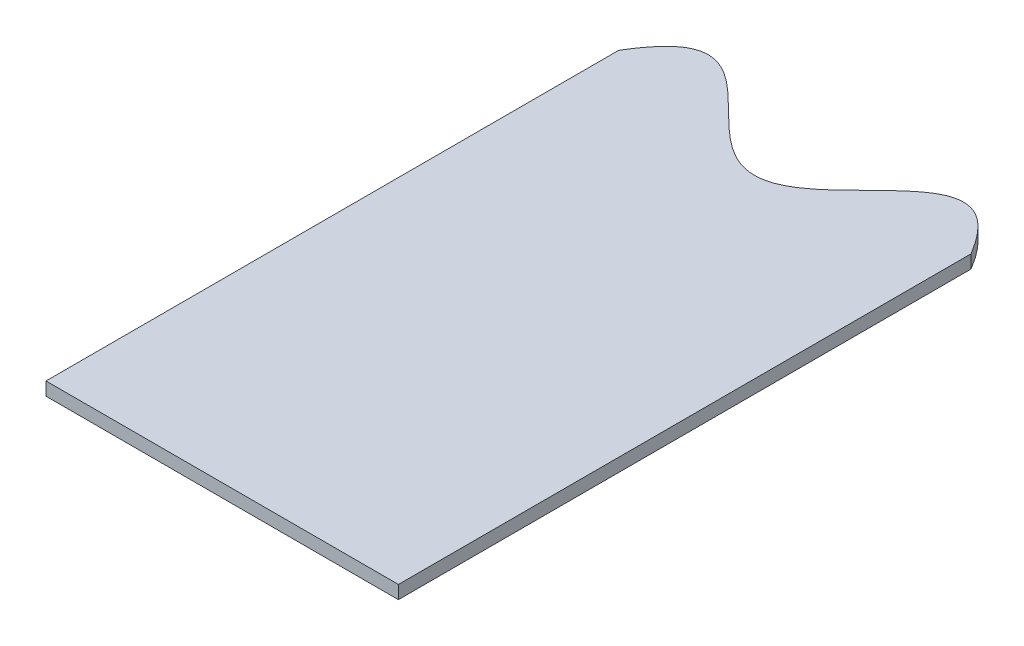
ISO-10303-21;
HEADER;
FILE_DESCRIPTION(('STEP AP214'),'2;1');
FILE_NAME('part.step','',(''),(''),'','','');
FILE_SCHEMA(('AUTOMOTIVE_DESIGN { 1 0 10303 214 1 1 1 1 }'));
ENDSEC;
DATA;
#1=APPLICATION_CONTEXT('core data for automotive mechanical design processes');
#2=APPLICATION_PROTOCOL_DEFINITION('international standard','automotive_design',2000,#1);
#3=PRODUCT_CONTEXT('',#1,'mechanical');
#4=PRODUCT('Part','Part','',(#3));
#5=PRODUCT_RELATED_PRODUCT_CATEGORY('part','',(#4));
#6=PRODUCT_DEFINITION_FORMATION('','',#4);
#7=PRODUCT_DEFINITION_CONTEXT('part definition',#1,'design');
#8=PRODUCT_DEFINITION('design','',#6,#7);
#9=PRODUCT_DEFINITION_SHAPE('','',#8);
#10=(LENGTH_UNIT() NAMED_UNIT(*) SI_UNIT(.MILLI.,.METRE.));
#11=(NAMED_UNIT(*) PLANE_ANGLE_UNIT() SI_UNIT($,.RADIAN.));
#12=(NAMED_UNIT(*) SI_UNIT($,.STERADIAN.) SOLID_ANGLE_UNIT());
#13=UNCERTAINTY_MEASURE_WITH_UNIT(LENGTH_MEASURE(1.E-05),#10,'distance_accuracy_value','');
#14=(GEOMETRIC_REPRESENTATION_CONTEXT(3) GLOBAL_UNCERTAINTY_ASSIGNED_CONTEXT((#13)) GLOBAL_UNIT_ASSIGNED_CONTEXT((#10,
#11,#12)) REPRESENTATION_CONTEXT('',''));
#15=CARTESIAN_POINT('',(0.,0.,0.));
#16=DIRECTION('',(0.,0.,1.));
#17=DIRECTION('',(1.,0.,0.));
#18=AXIS2_PLACEMENT_3D('',#15,#16,#17);
#19=CARTESIAN_POINT('',(92.098997524793,3.,-3.06496796592482));
#20=CARTESIAN_POINT('',(80.6704260962216,3.,-22.1227009920339));
#21=CARTESIAN_POINT('',(69.2418546676502,3.,-22.1227009920339));
#22=CARTESIAN_POINT('',(57.8132832390787,3.,28.9350320340752));
#23=CARTESIAN_POINT('',(46.3847118105073,3.,28.9350320340752));
#24=CARTESIAN_POINT('',(34.9561403819359,3.,-22.1227009920339));
#25=CARTESIAN_POINT('',(23.5275689533645,3.,-22.1227009920339));
#26=CARTESIAN_POINT('',(12.098997524793,3.,-3.06496796592482));
#27=B_SPLINE_CURVE_WITH_KNOTS('',7,(#19,#20,#21,#22,#23,#24,#25,#26),.UNSPECIFIED.,.F.,.F.,(8,
8),(0.,1.),.UNSPECIFIED.);
#28=DIRECTION('',(0.,-1.,0.));
#29=VECTOR('',#28,1.);
#30=SURFACE_OF_LINEAR_EXTRUSION('',#27,#29);
#31=CARTESIAN_POINT('',(92.098997524793,0.,-3.06496796592482));
#32=CARTESIAN_POINT('',(80.6704260962216,0.,-22.1227009920339));
#33=CARTESIAN_POINT('',(69.2418546676502,0.,-22.1227009920339));
#34=CARTESIAN_POINT('',(57.8132832390787,0.,28.9350320340752));
#35=CARTESIAN_POINT('',(46.3847118105073,0.,28.9350320340752));
#36=CARTESIAN_POINT('',(34.9561403819359,0.,-22.1227009920339));
#37=CARTESIAN_POINT('',(23.5275689533645,0.,-22.1227009920339));
#38=CARTESIAN_POINT('',(12.098997524793,0.,-3.06496796592482));
#39=B_SPLINE_CURVE_WITH_KNOTS('',7,(#31,#32,#33,#34,#35,#36,#37,#38),.UNSPECIFIED.,.F.,.F.,(8,
8),(0.,1.),.UNSPECIFIED.);
#40=CARTESIAN_POINT('',(92.098997524793,0.,-3.06496796592482));
#41=VERTEX_POINT('',#40);
#42=CARTESIAN_POINT('',(12.098997524793,0.,-3.06496796592482));
#43=VERTEX_POINT('',#42);
#44=EDGE_CURVE('E99',#41,#43,#39,.T.);
#45=ORIENTED_EDGE('',*,*,#44,.T.);
#46=DIRECTION('',(0.,-1.,0.));
#47=VECTOR('',#46,1.);
#48=CARTESIAN_POINT('',(12.098997524793,3.,-3.06496796592482));
#49=LINE('',#48,#47);
#50=CARTESIAN_POINT('',(12.098997524793,3.,-3.06496796592482));
#51=VERTEX_POINT('',#50);
#52=EDGE_CURVE('E11',#51,#43,#49,.T.);
#53=ORIENTED_EDGE('',*,*,#52,.F.);
#54=CARTESIAN_POINT('',(92.098997524793,3.,-3.06496796592482));
#55=VERTEX_POINT('',#54);
#56=EDGE_CURVE('E88',#55,#51,#27,.T.);
#57=ORIENTED_EDGE('',*,*,#56,.F.);
#58=DIRECTION('',(0.,-1.,0.));
#59=VECTOR('',#58,1.);
#60=CARTESIAN_POINT('',(92.098997524793,3.,-3.06496796592482));
#61=LINE('',#60,#59);
#62=EDGE_CURVE('E96',#55,#41,#61,.T.);
#63=ORIENTED_EDGE('',*,*,#62,.T.);
#64=EDGE_LOOP('',(#45,#53,#57,#63));
#65=FACE_BOUND('',#64,.T.);
#66=ADVANCED_FACE('F36',(#65),#30,.F.);
#67=CARTESIAN_POINT('',(12.098997524793,3.,126.935032034075));
#68=DIRECTION('',(1.,0.,0.));
#69=DIRECTION('',(0.,0.,-1.));
#70=AXIS2_PLACEMENT_3D('',#67,#68,#69);
#71=PLANE('',#70);
#72=DIRECTION('',(0.,0.,1.));
#73=VECTOR('',#72,1.);
#74=CARTESIAN_POINT('',(12.098997524793,0.,126.935032034075));
#75=LINE('',#74,#73);
#76=CARTESIAN_POINT('',(12.098997524793,0.,126.935032034075));
#77=VERTEX_POINT('',#76);
#78=EDGE_CURVE('E92',#43,#77,#75,.T.);
#79=ORIENTED_EDGE('',*,*,#78,.T.);
#80=DIRECTION('',(0.,-1.,0.));
#81=VECTOR('',#80,1.);
#82=CARTESIAN_POINT('',(12.098997524793,3.,126.935032034075));
#83=LINE('',#82,#81);
#84=CARTESIAN_POINT('',(12.098997524793,3.,126.935032034075));
#85=VERTEX_POINT('',#84);
#86=EDGE_CURVE('E45',#85,#77,#83,.T.);
#87=ORIENTED_EDGE('',*,*,#86,.F.);
#88=DIRECTION('',(0.,0.,1.));
#89=VECTOR('',#88,1.);
#90=CARTESIAN_POINT('',(12.098997524793,3.,126.935032034075));
#91=LINE('',#90,#89);
#92=EDGE_CURVE('E83',#51,#85,#91,.T.);
#93=ORIENTED_EDGE('',*,*,#92,.F.);
#94=ORIENTED_EDGE('',*,*,#52,.T.);
#95=EDGE_LOOP('',(#79,#87,#93,#94));
#96=FACE_BOUND('',#95,.T.);
#97=ADVANCED_FACE('F91',(#96),#71,.F.);
#98=CARTESIAN_POINT('',(92.098997524793,3.,126.935032034075));
#99=DIRECTION('',(0.,0.,-1.));
#100=DIRECTION('',(-1.,0.,0.));
#101=AXIS2_PLACEMENT_3D('',#98,#99,#100);
#102=PLANE('',#101);
#103=DIRECTION('',(1.,0.,0.));
#104=VECTOR('',#103,1.);
#105=CARTESIAN_POINT('',(92.098997524793,0.,126.935032034075));
#106=LINE('',#105,#104);
#107=CARTESIAN_POINT('',(92.098997524793,0.,126.935032034075));
#108=VERTEX_POINT('',#107);
#109=EDGE_CURVE('E70',#77,#108,#106,.T.);
#110=ORIENTED_EDGE('',*,*,#109,.T.);
#111=DIRECTION('',(0.,-1.,0.));
#112=VECTOR('',#111,1.);
#113=CARTESIAN_POINT('',(92.098997524793,3.,126.935032034075));
#114=LINE('',#113,#112);
#115=CARTESIAN_POINT('',(92.098997524793,3.,126.935032034075));
#116=VERTEX_POINT('',#115);
#117=EDGE_CURVE('E93',#116,#108,#114,.T.);
#118=ORIENTED_EDGE('',*,*,#117,.F.);
#119=DIRECTION('',(1.,0.,0.));
#120=VECTOR('',#119,1.);
#121=CARTESIAN_POINT('',(92.098997524793,3.,126.935032034075));
#122=LINE('',#121,#120);
#123=EDGE_CURVE('E86',#85,#116,#122,.T.);
#124=ORIENTED_EDGE('',*,*,#123,.F.);
#125=ORIENTED_EDGE('',*,*,#86,.T.);
#126=EDGE_LOOP('',(#110,#118,#124,#125));
#127=FACE_BOUND('',#126,.T.);
#128=ADVANCED_FACE('F94',(#127),#102,.F.);
#129=CARTESIAN_POINT('',(92.098997524793,3.,-3.06496796592482));
#130=DIRECTION('',(-1.,0.,0.));
#131=DIRECTION('',(0.,0.,1.));
#132=AXIS2_PLACEMENT_3D('',#129,#130,#131);
#133=PLANE('',#132);
#134=DIRECTION('',(0.,0.,-1.));
#135=VECTOR('',#134,1.);
#136=CARTESIAN_POINT('',(92.098997524793,0.,-3.06496796592482));
#137=LINE('',#136,#135);
#138=EDGE_CURVE('E76',#108,#41,#137,.T.);
#139=ORIENTED_EDGE('',*,*,#138,.T.);
#140=ORIENTED_EDGE('',*,*,#62,.F.);
#141=DIRECTION('',(0.,0.,-1.));
#142=VECTOR('',#141,1.);
#143=CARTESIAN_POINT('',(92.098997524793,3.,-3.06496796592482));
#144=LINE('',#143,#142);
#145=EDGE_CURVE('E53',#116,#55,#144,.T.);
#146=ORIENTED_EDGE('',*,*,#145,.F.);
#147=ORIENTED_EDGE('',*,*,#117,.T.);
#148=EDGE_LOOP('',(#139,#140,#146,#147));
#149=FACE_BOUND('',#148,.T.);
#150=ADVANCED_FACE('F111',(#149),#133,.F.);
#151=CARTESIAN_POINT('',(52.098997524793,3.,6.09727383515245));
#152=DIRECTION('',(0.,1.,0.));
#153=DIRECTION('',(0.,0.,1.));
#154=AXIS2_PLACEMENT_3D('',#151,#152,#153);
#155=PLANE('',#154);
#156=ORIENTED_EDGE('',*,*,#56,.T.);
#157=ORIENTED_EDGE('',*,*,#92,.T.);
#158=ORIENTED_EDGE('',*,*,#123,.T.);
#159=ORIENTED_EDGE('',*,*,#145,.T.);
#160=EDGE_LOOP('',(#156,#157,#158,#159));
#161=FACE_BOUND('',#160,.T.);
#162=ADVANCED_FACE('F84',(#161),#155,.T.);
#163=CARTESIAN_POINT('',(52.098997524793,0.,6.09727383515245));
#164=DIRECTION('',(0.,1.,0.));
#165=DIRECTION('',(0.,0.,1.));
#166=AXIS2_PLACEMENT_3D('',#163,#164,#165);
#167=PLANE('',#166);
#168=ORIENTED_EDGE('',*,*,#44,.F.);
#169=ORIENTED_EDGE('',*,*,#138,.F.);
#170=ORIENTED_EDGE('',*,*,#109,.F.);
#171=ORIENTED_EDGE('',*,*,#78,.F.);
#172=EDGE_LOOP('',(#168,#169,#170,#171));
#173=FACE_BOUND('',#172,.T.);
#174=ADVANCED_FACE('F114',(#173),#167,.F.);
#175=CLOSED_SHELL('',(#66,#97,#128,#150,#162,#174));
#176=MANIFOLD_SOLID_BREP('B2',#175);
#177=ADVANCED_BREP_SHAPE_REPRESENTATION('',(#18,#176),#14);
#178=SHAPE_DEFINITION_REPRESENTATION(#9,#177);
ENDSEC;
END-ISO-10303-21;
